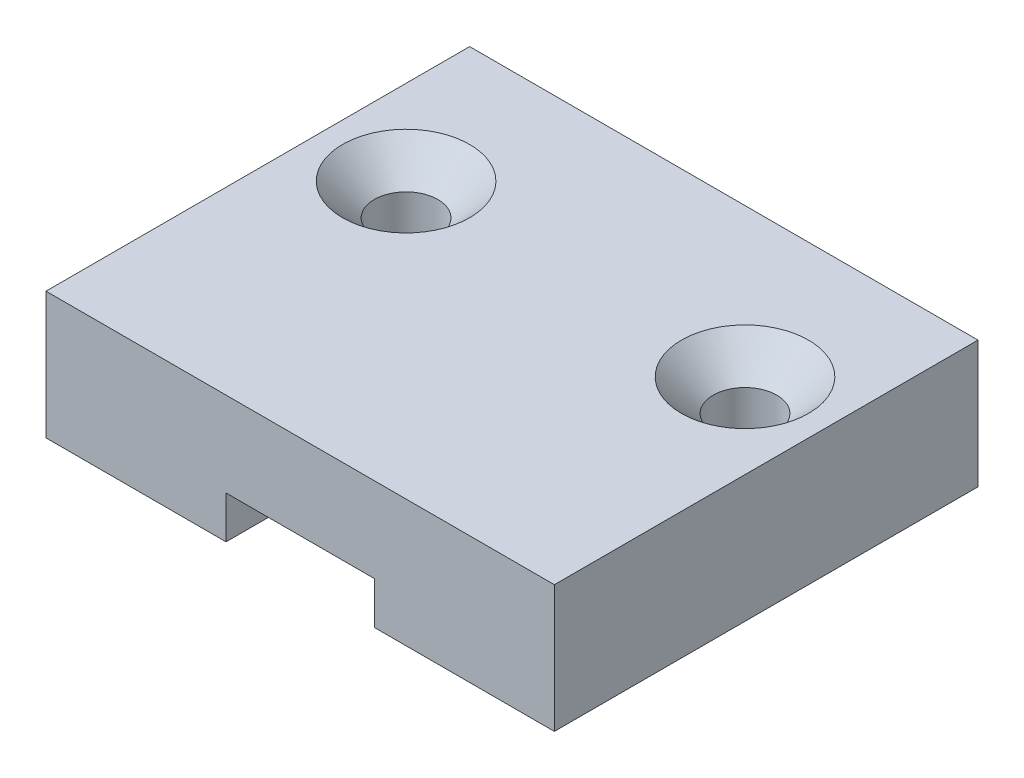
ISO-10303-21;
HEADER;
FILE_DESCRIPTION(('STEP AP214'),'2;1');
FILE_NAME('part.step','',(''),(''),'','','');
FILE_SCHEMA(('AUTOMOTIVE_DESIGN { 1 0 10303 214 1 1 1 1 }'));
ENDSEC;
DATA;
#1=APPLICATION_CONTEXT('core data for automotive mechanical design processes');
#2=APPLICATION_PROTOCOL_DEFINITION('international standard','automotive_design',2000,#1);
#3=PRODUCT_CONTEXT('',#1,'mechanical');
#4=PRODUCT('Part','Part','',(#3));
#5=PRODUCT_RELATED_PRODUCT_CATEGORY('part','',(#4));
#6=PRODUCT_DEFINITION_FORMATION('','',#4);
#7=PRODUCT_DEFINITION_CONTEXT('part definition',#1,'design');
#8=PRODUCT_DEFINITION('design','',#6,#7);
#9=PRODUCT_DEFINITION_SHAPE('','',#8);
#10=(LENGTH_UNIT() NAMED_UNIT(*) SI_UNIT(.MILLI.,.METRE.));
#11=(NAMED_UNIT(*) PLANE_ANGLE_UNIT() SI_UNIT($,.RADIAN.));
#12=(NAMED_UNIT(*) SI_UNIT($,.STERADIAN.) SOLID_ANGLE_UNIT());
#13=UNCERTAINTY_MEASURE_WITH_UNIT(LENGTH_MEASURE(1.E-05),#10,'distance_accuracy_value','');
#14=(GEOMETRIC_REPRESENTATION_CONTEXT(3) GLOBAL_UNCERTAINTY_ASSIGNED_CONTEXT((#13)) GLOBAL_UNIT_ASSIGNED_CONTEXT((#10,
#11,#12)) REPRESENTATION_CONTEXT('',''));
#15=CARTESIAN_POINT('',(0.,0.,0.));
#16=DIRECTION('',(0.,0.,1.));
#17=DIRECTION('',(1.,0.,0.));
#18=AXIS2_PLACEMENT_3D('',#15,#16,#17);
#19=CARTESIAN_POINT('',(0.,0.,0.));
#20=DIRECTION('',(0.,1.,0.));
#21=DIRECTION('',(0.,0.,1.));
#22=AXIS2_PLACEMENT_3D('',#19,#20,#21);
#23=PLANE('',#22);
#24=CARTESIAN_POINT('',(8.,0.,-13.));
#25=DIRECTION('',(0.,1.,0.));
#26=DIRECTION('',(0.,0.,1.));
#27=AXIS2_PLACEMENT_3D('',#24,#25,#26);
#28=CIRCLE('',#27,1.5);
#29=CARTESIAN_POINT('',(8.,0.,-11.5));
#30=VERTEX_POINT('',#29);
#31=EDGE_CURVE('E192',#30,#30,#28,.T.);
#32=ORIENTED_EDGE('',*,*,#31,.T.);
#33=EDGE_LOOP('',(#32));
#34=FACE_BOUND('',#33,.T.);
#35=DIRECTION('',(1.,0.,0.));
#36=VECTOR('',#35,1.);
#37=CARTESIAN_POINT('',(-12.,0.,0.));
#38=LINE('',#37,#36);
#39=CARTESIAN_POINT('',(3.5,0.,0.));
#40=VERTEX_POINT('',#39);
#41=CARTESIAN_POINT('',(12.,0.,0.));
#42=VERTEX_POINT('',#41);
#43=EDGE_CURVE('E207',#40,#42,#38,.T.);
#44=ORIENTED_EDGE('',*,*,#43,.F.);
#45=DIRECTION('',(0.,0.,1.));
#46=VECTOR('',#45,1.);
#47=CARTESIAN_POINT('',(3.5,0.,0.));
#48=LINE('',#47,#46);
#49=CARTESIAN_POINT('',(3.5,0.,-2.));
#50=VERTEX_POINT('',#49);
#51=EDGE_CURVE('E177',#50,#40,#48,.T.);
#52=ORIENTED_EDGE('',*,*,#51,.F.);
#53=DIRECTION('',(-1.,0.,0.));
#54=VECTOR('',#53,1.);
#55=CARTESIAN_POINT('',(3.5,0.,-2.));
#56=LINE('',#55,#54);
#57=CARTESIAN_POINT('',(7.,0.,-2.));
#58=VERTEX_POINT('',#57);
#59=EDGE_CURVE('E293',#58,#50,#56,.T.);
#60=ORIENTED_EDGE('',*,*,#59,.F.);
#61=DIRECTION('',(0.,0.,1.));
#62=VECTOR('',#61,1.);
#63=CARTESIAN_POINT('',(7.,0.,-2.));
#64=LINE('',#63,#62);
#65=CARTESIAN_POINT('',(7.,0.,-6.));
#66=VERTEX_POINT('',#65);
#67=EDGE_CURVE('E290',#66,#58,#64,.T.);
#68=ORIENTED_EDGE('',*,*,#67,.F.);
#69=DIRECTION('',(1.,0.,0.));
#70=VECTOR('',#69,1.);
#71=CARTESIAN_POINT('',(7.,0.,-6.));
#72=LINE('',#71,#70);
#73=CARTESIAN_POINT('',(6.,0.,-6.));
#74=VERTEX_POINT('',#73);
#75=EDGE_CURVE('E287',#74,#66,#72,.T.);
#76=ORIENTED_EDGE('',*,*,#75,.F.);
#77=DIRECTION('',(0.,0.,1.));
#78=VECTOR('',#77,1.);
#79=CARTESIAN_POINT('',(6.,0.,-6.));
#80=LINE('',#79,#78);
#81=CARTESIAN_POINT('',(6.,0.,-20.));
#82=VERTEX_POINT('',#81);
#83=EDGE_CURVE('E284',#82,#74,#80,.T.);
#84=ORIENTED_EDGE('',*,*,#83,.F.);
#85=DIRECTION('',(-1.,0.,0.));
#86=VECTOR('',#85,1.);
#87=CARTESIAN_POINT('',(-12.,0.,-20.));
#88=LINE('',#87,#86);
#89=CARTESIAN_POINT('',(12.,0.,-20.));
#90=VERTEX_POINT('',#89);
#91=EDGE_CURVE('E199',#90,#82,#88,.T.);
#92=ORIENTED_EDGE('',*,*,#91,.F.);
#93=DIRECTION('',(0.,0.,-1.));
#94=VECTOR('',#93,1.);
#95=CARTESIAN_POINT('',(12.,0.,-20.));
#96=LINE('',#95,#94);
#97=EDGE_CURVE('E209',#42,#90,#96,.T.);
#98=ORIENTED_EDGE('',*,*,#97,.F.);
#99=EDGE_LOOP('',(#44,#52,#60,#68,#76,#84,#92,#98));
#100=FACE_BOUND('',#99,.T.);
#101=ADVANCED_FACE('F33',(#34,#100),#23,.F.);
#102=CARTESIAN_POINT('',(0.,6.,0.));
#103=DIRECTION('',(0.,1.,0.));
#104=DIRECTION('',(0.,0.,1.));
#105=AXIS2_PLACEMENT_3D('',#102,#103,#104);
#106=PLANE('',#105);
#107=CARTESIAN_POINT('',(8.,6.,-13.));
#108=DIRECTION('',(0.,1.,0.));
#109=DIRECTION('',(0.,0.,1.));
#110=AXIS2_PLACEMENT_3D('',#107,#108,#109);
#111=CIRCLE('',#110,3.);
#112=CARTESIAN_POINT('',(8.,6.,-10.));
#113=VERTEX_POINT('',#112);
#114=EDGE_CURVE('E41',#113,#113,#111,.F.);
#115=ORIENTED_EDGE('',*,*,#114,.T.);
#116=EDGE_LOOP('',(#115));
#117=FACE_BOUND('',#116,.T.);
#118=CARTESIAN_POINT('',(-8.,6.,-13.));
#119=DIRECTION('',(0.,1.,0.));
#120=DIRECTION('',(0.,0.,1.));
#121=AXIS2_PLACEMENT_3D('',#118,#119,#120);
#122=CIRCLE('',#121,3.);
#123=CARTESIAN_POINT('',(-8.,6.,-10.));
#124=VERTEX_POINT('',#123);
#125=EDGE_CURVE('E225',#124,#124,#122,.F.);
#126=ORIENTED_EDGE('',*,*,#125,.T.);
#127=EDGE_LOOP('',(#126));
#128=FACE_BOUND('',#127,.T.);
#129=DIRECTION('',(0.,0.,1.));
#130=VECTOR('',#129,1.);
#131=CARTESIAN_POINT('',(-12.,6.,-20.));
#132=LINE('',#131,#130);
#133=CARTESIAN_POINT('',(-12.,6.,-20.));
#134=VERTEX_POINT('',#133);
#135=CARTESIAN_POINT('',(-12.,6.,0.));
#136=VERTEX_POINT('',#135);
#137=EDGE_CURVE('E197',#134,#136,#132,.T.);
#138=ORIENTED_EDGE('',*,*,#137,.T.);
#139=DIRECTION('',(1.,0.,0.));
#140=VECTOR('',#139,1.);
#141=CARTESIAN_POINT('',(-12.,6.,0.));
#142=LINE('',#141,#140);
#143=CARTESIAN_POINT('',(12.,6.,0.));
#144=VERTEX_POINT('',#143);
#145=EDGE_CURVE('E86',#136,#144,#142,.T.);
#146=ORIENTED_EDGE('',*,*,#145,.T.);
#147=DIRECTION('',(0.,0.,-1.));
#148=VECTOR('',#147,1.);
#149=CARTESIAN_POINT('',(12.,6.,-20.));
#150=LINE('',#149,#148);
#151=CARTESIAN_POINT('',(12.,6.,-20.));
#152=VERTEX_POINT('',#151);
#153=EDGE_CURVE('E201',#144,#152,#150,.T.);
#154=ORIENTED_EDGE('',*,*,#153,.T.);
#155=DIRECTION('',(-1.,0.,0.));
#156=VECTOR('',#155,1.);
#157=CARTESIAN_POINT('',(-12.,6.,-20.));
#158=LINE('',#157,#156);
#159=EDGE_CURVE('E57',#152,#134,#158,.T.);
#160=ORIENTED_EDGE('',*,*,#159,.T.);
#161=EDGE_LOOP('',(#138,#146,#154,#160));
#162=FACE_BOUND('',#161,.T.);
#163=ADVANCED_FACE('F230',(#117,#128,#162),#106,.T.);
#164=CARTESIAN_POINT('',(-6.,0.,-20.));
#165=VERTEX_POINT('',#164);
#166=CARTESIAN_POINT('',(-12.,0.,-20.));
#167=VERTEX_POINT('',#166);
#168=EDGE_CURVE('E78',#165,#167,#88,.T.);
#169=ORIENTED_EDGE('',*,*,#168,.F.);
#170=DIRECTION('',(0.,0.,-1.));
#171=VECTOR('',#170,1.);
#172=CARTESIAN_POINT('',(-6.,0.,-6.));
#173=LINE('',#172,#171);
#174=CARTESIAN_POINT('',(-6.,0.,-6.));
#175=VERTEX_POINT('',#174);
#176=EDGE_CURVE('E282',#175,#165,#173,.T.);
#177=ORIENTED_EDGE('',*,*,#176,.F.);
#178=DIRECTION('',(1.,0.,0.));
#179=VECTOR('',#178,1.);
#180=CARTESIAN_POINT('',(-7.,0.,-6.));
#181=LINE('',#180,#179);
#182=CARTESIAN_POINT('',(-7.,0.,-6.));
#183=VERTEX_POINT('',#182);
#184=EDGE_CURVE('E279',#183,#175,#181,.T.);
#185=ORIENTED_EDGE('',*,*,#184,.F.);
#186=DIRECTION('',(0.,0.,-1.));
#187=VECTOR('',#186,1.);
#188=CARTESIAN_POINT('',(-7.,0.,-2.));
#189=LINE('',#188,#187);
#190=CARTESIAN_POINT('',(-7.,0.,-2.));
#191=VERTEX_POINT('',#190);
#192=EDGE_CURVE('E273',#191,#183,#189,.T.);
#193=ORIENTED_EDGE('',*,*,#192,.F.);
#194=DIRECTION('',(-1.,0.,0.));
#195=VECTOR('',#194,1.);
#196=CARTESIAN_POINT('',(-3.5,0.,-2.));
#197=LINE('',#196,#195);
#198=CARTESIAN_POINT('',(-3.5,0.,-2.));
#199=VERTEX_POINT('',#198);
#200=EDGE_CURVE('E271',#199,#191,#197,.T.);
#201=ORIENTED_EDGE('',*,*,#200,.F.);
#202=DIRECTION('',(0.,0.,-1.));
#203=VECTOR('',#202,1.);
#204=CARTESIAN_POINT('',(-3.5,0.,0.));
#205=LINE('',#204,#203);
#206=CARTESIAN_POINT('',(-3.5,0.,0.));
#207=VERTEX_POINT('',#206);
#208=EDGE_CURVE('E268',#207,#199,#205,.T.);
#209=ORIENTED_EDGE('',*,*,#208,.F.);
#210=CARTESIAN_POINT('',(-12.,0.,0.));
#211=VERTEX_POINT('',#210);
#212=EDGE_CURVE('E181',#211,#207,#38,.T.);
#213=ORIENTED_EDGE('',*,*,#212,.F.);
#214=DIRECTION('',(0.,0.,1.));
#215=VECTOR('',#214,1.);
#216=CARTESIAN_POINT('',(-12.,0.,-20.));
#217=LINE('',#216,#215);
#218=EDGE_CURVE('E196',#167,#211,#217,.T.);
#219=ORIENTED_EDGE('',*,*,#218,.F.);
#220=EDGE_LOOP('',(#169,#177,#185,#193,#201,#209,#213,#219));
#221=FACE_BOUND('',#220,.T.);
#222=CARTESIAN_POINT('',(-8.,0.,-13.));
#223=DIRECTION('',(0.,1.,0.));
#224=DIRECTION('',(0.,0.,-1.));
#225=AXIS2_PLACEMENT_3D('',#222,#223,#224);
#226=CIRCLE('',#225,1.5);
#227=CARTESIAN_POINT('',(-8.,0.,-14.5));
#228=VERTEX_POINT('',#227);
#229=EDGE_CURVE('E189',#228,#228,#226,.T.);
#230=ORIENTED_EDGE('',*,*,#229,.T.);
#231=EDGE_LOOP('',(#230));
#232=FACE_BOUND('',#231,.T.);
#233=ADVANCED_FACE('F249',(#221,#232),#23,.F.);
#234=CARTESIAN_POINT('',(-12.,6.,-20.));
#235=DIRECTION('',(1.,0.,0.));
#236=DIRECTION('',(0.,0.,-1.));
#237=AXIS2_PLACEMENT_3D('',#234,#235,#236);
#238=PLANE('',#237);
#239=ORIENTED_EDGE('',*,*,#218,.T.);
#240=DIRECTION('',(0.,-1.,0.));
#241=VECTOR('',#240,1.);
#242=CARTESIAN_POINT('',(-12.,6.,0.));
#243=LINE('',#242,#241);
#244=EDGE_CURVE('E220',#136,#211,#243,.T.);
#245=ORIENTED_EDGE('',*,*,#244,.F.);
#246=ORIENTED_EDGE('',*,*,#137,.F.);
#247=DIRECTION('',(0.,-1.,0.));
#248=VECTOR('',#247,1.);
#249=CARTESIAN_POINT('',(-12.,6.,-20.));
#250=LINE('',#249,#248);
#251=EDGE_CURVE('E204',#134,#167,#250,.T.);
#252=ORIENTED_EDGE('',*,*,#251,.T.);
#253=EDGE_LOOP('',(#239,#245,#246,#252));
#254=FACE_BOUND('',#253,.T.);
#255=ADVANCED_FACE('F262',(#254),#238,.F.);
#256=CARTESIAN_POINT('',(-12.,6.,0.));
#257=DIRECTION('',(0.,0.,-1.));
#258=DIRECTION('',(-1.,0.,0.));
#259=AXIS2_PLACEMENT_3D('',#256,#257,#258);
#260=PLANE('',#259);
#261=DIRECTION('',(-1.,0.,0.));
#262=VECTOR('',#261,1.);
#263=CARTESIAN_POINT('',(-3.5,2.,0.));
#264=LINE('',#263,#262);
#265=CARTESIAN_POINT('',(3.5,2.,0.));
#266=VERTEX_POINT('',#265);
#267=CARTESIAN_POINT('',(-3.5,2.,0.));
#268=VERTEX_POINT('',#267);
#269=EDGE_CURVE('E168',#266,#268,#264,.T.);
#270=ORIENTED_EDGE('',*,*,#269,.F.);
#271=DIRECTION('',(0.,-1.,0.));
#272=VECTOR('',#271,1.);
#273=CARTESIAN_POINT('',(3.5,2.,0.));
#274=LINE('',#273,#272);
#275=EDGE_CURVE('E193',#266,#40,#274,.T.);
#276=ORIENTED_EDGE('',*,*,#275,.T.);
#277=ORIENTED_EDGE('',*,*,#43,.T.);
#278=DIRECTION('',(0.,-1.,0.));
#279=VECTOR('',#278,1.);
#280=CARTESIAN_POINT('',(12.,6.,0.));
#281=LINE('',#280,#279);
#282=EDGE_CURVE('E217',#144,#42,#281,.T.);
#283=ORIENTED_EDGE('',*,*,#282,.F.);
#284=ORIENTED_EDGE('',*,*,#145,.F.);
#285=ORIENTED_EDGE('',*,*,#244,.T.);
#286=ORIENTED_EDGE('',*,*,#212,.T.);
#287=DIRECTION('',(0.,-1.,0.));
#288=VECTOR('',#287,1.);
#289=CARTESIAN_POINT('',(-3.5,2.,0.));
#290=LINE('',#289,#288);
#291=EDGE_CURVE('E162',#268,#207,#290,.T.);
#292=ORIENTED_EDGE('',*,*,#291,.F.);
#293=EDGE_LOOP('',(#270,#276,#277,#283,#284,#285,#286,#292));
#294=FACE_BOUND('',#293,.T.);
#295=ADVANCED_FACE('F180',(#294),#260,.F.);
#296=CARTESIAN_POINT('',(12.,6.,-20.));
#297=DIRECTION('',(-1.,0.,0.));
#298=DIRECTION('',(0.,0.,1.));
#299=AXIS2_PLACEMENT_3D('',#296,#297,#298);
#300=PLANE('',#299);
#301=ORIENTED_EDGE('',*,*,#97,.T.);
#302=DIRECTION('',(0.,-1.,0.));
#303=VECTOR('',#302,1.);
#304=CARTESIAN_POINT('',(12.,6.,-20.));
#305=LINE('',#304,#303);
#306=EDGE_CURVE('E214',#152,#90,#305,.T.);
#307=ORIENTED_EDGE('',*,*,#306,.F.);
#308=ORIENTED_EDGE('',*,*,#153,.F.);
#309=ORIENTED_EDGE('',*,*,#282,.T.);
#310=EDGE_LOOP('',(#301,#307,#308,#309));
#311=FACE_BOUND('',#310,.T.);
#312=ADVANCED_FACE('F257',(#311),#300,.F.);
#313=CARTESIAN_POINT('',(-12.,6.,-20.));
#314=DIRECTION('',(0.,0.,1.));
#315=DIRECTION('',(1.,0.,0.));
#316=AXIS2_PLACEMENT_3D('',#313,#314,#315);
#317=PLANE('',#316);
#318=ORIENTED_EDGE('',*,*,#91,.T.);
#319=DIRECTION('',(0.,-1.,0.));
#320=VECTOR('',#319,1.);
#321=CARTESIAN_POINT('',(6.,2.,-20.));
#322=LINE('',#321,#320);
#323=CARTESIAN_POINT('',(6.,2.,-20.));
#324=VERTEX_POINT('',#323);
#325=EDGE_CURVE('E306',#324,#82,#322,.T.);
#326=ORIENTED_EDGE('',*,*,#325,.F.);
#327=DIRECTION('',(1.,0.,0.));
#328=VECTOR('',#327,1.);
#329=CARTESIAN_POINT('',(-6.,2.,-20.));
#330=LINE('',#329,#328);
#331=CARTESIAN_POINT('',(-6.,2.,-20.));
#332=VERTEX_POINT('',#331);
#333=EDGE_CURVE('E330',#332,#324,#330,.T.);
#334=ORIENTED_EDGE('',*,*,#333,.F.);
#335=DIRECTION('',(0.,-1.,0.));
#336=VECTOR('',#335,1.);
#337=CARTESIAN_POINT('',(-6.,2.,-20.));
#338=LINE('',#337,#336);
#339=EDGE_CURVE('E308',#332,#165,#338,.T.);
#340=ORIENTED_EDGE('',*,*,#339,.T.);
#341=ORIENTED_EDGE('',*,*,#168,.T.);
#342=ORIENTED_EDGE('',*,*,#251,.F.);
#343=ORIENTED_EDGE('',*,*,#159,.F.);
#344=ORIENTED_EDGE('',*,*,#306,.T.);
#345=EDGE_LOOP('',(#318,#326,#334,#340,#341,#342,#343,#344));
#346=FACE_BOUND('',#345,.T.);
#347=ADVANCED_FACE('F242',(#346),#317,.F.);
#348=CARTESIAN_POINT('',(8.,6.,-13.));
#349=DIRECTION('',(0.,-1.,0.));
#350=DIRECTION('',(0.,0.,-1.));
#351=AXIS2_PLACEMENT_3D('',#348,#349,#350);
#352=CYLINDRICAL_SURFACE('',#351,1.5);
#353=CARTESIAN_POINT('',(8.,4.5,-13.));
#354=DIRECTION('',(0.,1.,0.));
#355=DIRECTION('',(0.,0.,1.));
#356=AXIS2_PLACEMENT_3D('',#353,#354,#355);
#357=CIRCLE('',#356,1.5);
#358=CARTESIAN_POINT('',(8.,4.5,-11.5));
#359=VERTEX_POINT('',#358);
#360=EDGE_CURVE('E222',#359,#359,#357,.T.);
#361=ORIENTED_EDGE('',*,*,#360,.T.);
#362=EDGE_LOOP('',(#361));
#363=FACE_BOUND('',#362,.T.);
#364=ORIENTED_EDGE('',*,*,#31,.F.);
#365=EDGE_LOOP('',(#364));
#366=FACE_BOUND('',#365,.T.);
#367=ADVANCED_FACE('F238',(#363,#366),#352,.F.);
#368=CARTESIAN_POINT('',(-8.,6.,-13.));
#369=DIRECTION('',(0.,-1.,0.));
#370=DIRECTION('',(0.,0.,-1.));
#371=AXIS2_PLACEMENT_3D('',#368,#369,#370);
#372=CYLINDRICAL_SURFACE('',#371,1.5);
#373=CARTESIAN_POINT('',(-8.,4.5,-13.));
#374=DIRECTION('',(0.,1.,0.));
#375=DIRECTION('',(0.,0.,1.));
#376=AXIS2_PLACEMENT_3D('',#373,#374,#375);
#377=CIRCLE('',#376,1.5);
#378=CARTESIAN_POINT('',(-8.,4.5,-11.5));
#379=VERTEX_POINT('',#378);
#380=EDGE_CURVE('E11',#379,#379,#377,.T.);
#381=ORIENTED_EDGE('',*,*,#380,.T.);
#382=EDGE_LOOP('',(#381));
#383=FACE_BOUND('',#382,.T.);
#384=ORIENTED_EDGE('',*,*,#229,.F.);
#385=EDGE_LOOP('',(#384));
#386=FACE_BOUND('',#385,.T.);
#387=ADVANCED_FACE('F241',(#383,#386),#372,.F.);
#388=CARTESIAN_POINT('',(3.5,2.,0.));
#389=DIRECTION('',(1.,0.,0.));
#390=DIRECTION('',(0.,0.,-1.));
#391=AXIS2_PLACEMENT_3D('',#388,#389,#390);
#392=PLANE('',#391);
#393=ORIENTED_EDGE('',*,*,#51,.T.);
#394=ORIENTED_EDGE('',*,*,#275,.F.);
#395=DIRECTION('',(0.,0.,1.));
#396=VECTOR('',#395,1.);
#397=CARTESIAN_POINT('',(3.5,2.,0.));
#398=LINE('',#397,#396);
#399=CARTESIAN_POINT('',(3.5,2.,-2.));
#400=VERTEX_POINT('',#399);
#401=EDGE_CURVE('E175',#400,#266,#398,.T.);
#402=ORIENTED_EDGE('',*,*,#401,.F.);
#403=DIRECTION('',(0.,-1.,0.));
#404=VECTOR('',#403,1.);
#405=CARTESIAN_POINT('',(3.5,2.,-2.));
#406=LINE('',#405,#404);
#407=EDGE_CURVE('E298',#400,#50,#406,.T.);
#408=ORIENTED_EDGE('',*,*,#407,.T.);
#409=EDGE_LOOP('',(#393,#394,#402,#408));
#410=FACE_BOUND('',#409,.T.);
#411=ADVANCED_FACE('F344',(#410),#392,.F.);
#412=CARTESIAN_POINT('',(3.5,2.,-2.));
#413=DIRECTION('',(0.,0.,1.));
#414=DIRECTION('',(1.,0.,0.));
#415=AXIS2_PLACEMENT_3D('',#412,#413,#414);
#416=PLANE('',#415);
#417=ORIENTED_EDGE('',*,*,#59,.T.);
#418=ORIENTED_EDGE('',*,*,#407,.F.);
#419=DIRECTION('',(-1.,0.,0.));
#420=VECTOR('',#419,1.);
#421=CARTESIAN_POINT('',(3.5,2.,-2.));
#422=LINE('',#421,#420);
#423=CARTESIAN_POINT('',(7.,2.,-2.));
#424=VERTEX_POINT('',#423);
#425=EDGE_CURVE('E185',#424,#400,#422,.T.);
#426=ORIENTED_EDGE('',*,*,#425,.F.);
#427=DIRECTION('',(0.,-1.,0.));
#428=VECTOR('',#427,1.);
#429=CARTESIAN_POINT('',(7.,2.,-2.));
#430=LINE('',#429,#428);
#431=EDGE_CURVE('E300',#424,#58,#430,.T.);
#432=ORIENTED_EDGE('',*,*,#431,.T.);
#433=EDGE_LOOP('',(#417,#418,#426,#432));
#434=FACE_BOUND('',#433,.T.);
#435=ADVANCED_FACE('F345',(#434),#416,.F.);
#436=CARTESIAN_POINT('',(7.,2.,-2.));
#437=DIRECTION('',(1.,0.,0.));
#438=DIRECTION('',(0.,0.,-1.));
#439=AXIS2_PLACEMENT_3D('',#436,#437,#438);
#440=PLANE('',#439);
#441=ORIENTED_EDGE('',*,*,#67,.T.);
#442=ORIENTED_EDGE('',*,*,#431,.F.);
#443=DIRECTION('',(0.,0.,1.));
#444=VECTOR('',#443,1.);
#445=CARTESIAN_POINT('',(7.,2.,-2.));
#446=LINE('',#445,#444);
#447=CARTESIAN_POINT('',(7.,2.,-6.));
#448=VERTEX_POINT('',#447);
#449=EDGE_CURVE('E338',#448,#424,#446,.T.);
#450=ORIENTED_EDGE('',*,*,#449,.F.);
#451=DIRECTION('',(0.,-1.,0.));
#452=VECTOR('',#451,1.);
#453=CARTESIAN_POINT('',(7.,2.,-6.));
#454=LINE('',#453,#452);
#455=EDGE_CURVE('E302',#448,#66,#454,.T.);
#456=ORIENTED_EDGE('',*,*,#455,.T.);
#457=EDGE_LOOP('',(#441,#442,#450,#456));
#458=FACE_BOUND('',#457,.T.);
#459=ADVANCED_FACE('F350',(#458),#440,.F.);
#460=CARTESIAN_POINT('',(7.,2.,-6.));
#461=DIRECTION('',(0.,0.,-1.));
#462=DIRECTION('',(-1.,0.,0.));
#463=AXIS2_PLACEMENT_3D('',#460,#461,#462);
#464=PLANE('',#463);
#465=ORIENTED_EDGE('',*,*,#75,.T.);
#466=ORIENTED_EDGE('',*,*,#455,.F.);
#467=DIRECTION('',(1.,0.,0.));
#468=VECTOR('',#467,1.);
#469=CARTESIAN_POINT('',(7.,2.,-6.));
#470=LINE('',#469,#468);
#471=CARTESIAN_POINT('',(6.,2.,-6.));
#472=VERTEX_POINT('',#471);
#473=EDGE_CURVE('E335',#472,#448,#470,.T.);
#474=ORIENTED_EDGE('',*,*,#473,.F.);
#475=DIRECTION('',(0.,-1.,0.));
#476=VECTOR('',#475,1.);
#477=CARTESIAN_POINT('',(6.,2.,-6.));
#478=LINE('',#477,#476);
#479=EDGE_CURVE('E304',#472,#74,#478,.T.);
#480=ORIENTED_EDGE('',*,*,#479,.T.);
#481=EDGE_LOOP('',(#465,#466,#474,#480));
#482=FACE_BOUND('',#481,.T.);
#483=ADVANCED_FACE('F353',(#482),#464,.F.);
#484=CARTESIAN_POINT('',(6.,2.,-6.));
#485=DIRECTION('',(1.,0.,0.));
#486=DIRECTION('',(0.,0.,-1.));
#487=AXIS2_PLACEMENT_3D('',#484,#485,#486);
#488=PLANE('',#487);
#489=ORIENTED_EDGE('',*,*,#83,.T.);
#490=ORIENTED_EDGE('',*,*,#479,.F.);
#491=DIRECTION('',(0.,0.,1.));
#492=VECTOR('',#491,1.);
#493=CARTESIAN_POINT('',(6.,2.,-6.));
#494=LINE('',#493,#492);
#495=EDGE_CURVE('E332',#324,#472,#494,.T.);
#496=ORIENTED_EDGE('',*,*,#495,.F.);
#497=ORIENTED_EDGE('',*,*,#325,.T.);
#498=EDGE_LOOP('',(#489,#490,#496,#497));
#499=FACE_BOUND('',#498,.T.);
#500=ADVANCED_FACE('F355',(#499),#488,.F.);
#501=CARTESIAN_POINT('',(-6.,2.,-6.));
#502=DIRECTION('',(-1.,0.,0.));
#503=DIRECTION('',(0.,0.,1.));
#504=AXIS2_PLACEMENT_3D('',#501,#502,#503);
#505=PLANE('',#504);
#506=ORIENTED_EDGE('',*,*,#176,.T.);
#507=ORIENTED_EDGE('',*,*,#339,.F.);
#508=DIRECTION('',(0.,0.,-1.));
#509=VECTOR('',#508,1.);
#510=CARTESIAN_POINT('',(-6.,2.,-6.));
#511=LINE('',#510,#509);
#512=CARTESIAN_POINT('',(-6.,2.,-6.));
#513=VERTEX_POINT('',#512);
#514=EDGE_CURVE('E48',#513,#332,#511,.T.);
#515=ORIENTED_EDGE('',*,*,#514,.F.);
#516=DIRECTION('',(0.,-1.,0.));
#517=VECTOR('',#516,1.);
#518=CARTESIAN_POINT('',(-6.,2.,-6.));
#519=LINE('',#518,#517);
#520=EDGE_CURVE('E310',#513,#175,#519,.T.);
#521=ORIENTED_EDGE('',*,*,#520,.T.);
#522=EDGE_LOOP('',(#506,#507,#515,#521));
#523=FACE_BOUND('',#522,.T.);
#524=ADVANCED_FACE('F359',(#523),#505,.F.);
#525=CARTESIAN_POINT('',(-7.,2.,-6.));
#526=DIRECTION('',(0.,0.,-1.));
#527=DIRECTION('',(-1.,0.,0.));
#528=AXIS2_PLACEMENT_3D('',#525,#526,#527);
#529=PLANE('',#528);
#530=ORIENTED_EDGE('',*,*,#184,.T.);
#531=ORIENTED_EDGE('',*,*,#520,.F.);
#532=DIRECTION('',(1.,0.,0.));
#533=VECTOR('',#532,1.);
#534=CARTESIAN_POINT('',(-7.,2.,-6.));
#535=LINE('',#534,#533);
#536=CARTESIAN_POINT('',(-7.,2.,-6.));
#537=VERTEX_POINT('',#536);
#538=EDGE_CURVE('E324',#537,#513,#535,.T.);
#539=ORIENTED_EDGE('',*,*,#538,.F.);
#540=DIRECTION('',(0.,-1.,0.));
#541=VECTOR('',#540,1.);
#542=CARTESIAN_POINT('',(-7.,2.,-6.));
#543=LINE('',#542,#541);
#544=EDGE_CURVE('E312',#537,#183,#543,.T.);
#545=ORIENTED_EDGE('',*,*,#544,.T.);
#546=EDGE_LOOP('',(#530,#531,#539,#545));
#547=FACE_BOUND('',#546,.T.);
#548=ADVANCED_FACE('F322',(#547),#529,.F.);
#549=CARTESIAN_POINT('',(-7.,2.,-2.));
#550=DIRECTION('',(-1.,0.,0.));
#551=DIRECTION('',(0.,0.,1.));
#552=AXIS2_PLACEMENT_3D('',#549,#550,#551);
#553=PLANE('',#552);
#554=ORIENTED_EDGE('',*,*,#192,.T.);
#555=ORIENTED_EDGE('',*,*,#544,.F.);
#556=DIRECTION('',(0.,0.,-1.));
#557=VECTOR('',#556,1.);
#558=CARTESIAN_POINT('',(-7.,2.,-2.));
#559=LINE('',#558,#557);
#560=CARTESIAN_POINT('',(-7.,2.,-2.));
#561=VERTEX_POINT('',#560);
#562=EDGE_CURVE('E318',#561,#537,#559,.T.);
#563=ORIENTED_EDGE('',*,*,#562,.F.);
#564=DIRECTION('',(0.,-1.,0.));
#565=VECTOR('',#564,1.);
#566=CARTESIAN_POINT('',(-7.,2.,-2.));
#567=LINE('',#566,#565);
#568=EDGE_CURVE('E183',#561,#191,#567,.T.);
#569=ORIENTED_EDGE('',*,*,#568,.T.);
#570=EDGE_LOOP('',(#554,#555,#563,#569));
#571=FACE_BOUND('',#570,.T.);
#572=ADVANCED_FACE('F315',(#571),#553,.F.);
#573=CARTESIAN_POINT('',(-3.5,2.,-2.));
#574=DIRECTION('',(0.,0.,1.));
#575=DIRECTION('',(1.,0.,0.));
#576=AXIS2_PLACEMENT_3D('',#573,#574,#575);
#577=PLANE('',#576);
#578=ORIENTED_EDGE('',*,*,#200,.T.);
#579=ORIENTED_EDGE('',*,*,#568,.F.);
#580=DIRECTION('',(-1.,0.,0.));
#581=VECTOR('',#580,1.);
#582=CARTESIAN_POINT('',(-3.5,2.,-2.));
#583=LINE('',#582,#581);
#584=CARTESIAN_POINT('',(-3.5,2.,-2.));
#585=VERTEX_POINT('',#584);
#586=EDGE_CURVE('E167',#585,#561,#583,.T.);
#587=ORIENTED_EDGE('',*,*,#586,.F.);
#588=DIRECTION('',(0.,-1.,0.));
#589=VECTOR('',#588,1.);
#590=CARTESIAN_POINT('',(-3.5,2.,-2.));
#591=LINE('',#590,#589);
#592=EDGE_CURVE('E164',#585,#199,#591,.T.);
#593=ORIENTED_EDGE('',*,*,#592,.T.);
#594=EDGE_LOOP('',(#578,#579,#587,#593));
#595=FACE_BOUND('',#594,.T.);
#596=ADVANCED_FACE('F320',(#595),#577,.F.);
#597=CARTESIAN_POINT('',(-3.5,2.,0.));
#598=DIRECTION('',(-1.,0.,0.));
#599=DIRECTION('',(0.,0.,1.));
#600=AXIS2_PLACEMENT_3D('',#597,#598,#599);
#601=PLANE('',#600);
#602=ORIENTED_EDGE('',*,*,#208,.T.);
#603=ORIENTED_EDGE('',*,*,#592,.F.);
#604=DIRECTION('',(0.,0.,-1.));
#605=VECTOR('',#604,1.);
#606=CARTESIAN_POINT('',(-3.5,2.,0.));
#607=LINE('',#606,#605);
#608=EDGE_CURVE('E157',#268,#585,#607,.T.);
#609=ORIENTED_EDGE('',*,*,#608,.F.);
#610=ORIENTED_EDGE('',*,*,#291,.T.);
#611=EDGE_LOOP('',(#602,#603,#609,#610));
#612=FACE_BOUND('',#611,.T.);
#613=ADVANCED_FACE('F160',(#612),#601,.F.);
#614=CARTESIAN_POINT('',(0.,2.,0.));
#615=DIRECTION('',(0.,1.,0.));
#616=DIRECTION('',(0.,0.,1.));
#617=AXIS2_PLACEMENT_3D('',#614,#615,#616);
#618=PLANE('',#617);
#619=ORIENTED_EDGE('',*,*,#269,.T.);
#620=ORIENTED_EDGE('',*,*,#608,.T.);
#621=ORIENTED_EDGE('',*,*,#586,.T.);
#622=ORIENTED_EDGE('',*,*,#562,.T.);
#623=ORIENTED_EDGE('',*,*,#538,.T.);
#624=ORIENTED_EDGE('',*,*,#514,.T.);
#625=ORIENTED_EDGE('',*,*,#333,.T.);
#626=ORIENTED_EDGE('',*,*,#495,.T.);
#627=ORIENTED_EDGE('',*,*,#473,.T.);
#628=ORIENTED_EDGE('',*,*,#449,.T.);
#629=ORIENTED_EDGE('',*,*,#425,.T.);
#630=ORIENTED_EDGE('',*,*,#401,.T.);
#631=EDGE_LOOP('',(#619,#620,#621,#622,#623,#624,#625,#626,#627,#628,#629,#630));
#632=FACE_BOUND('',#631,.T.);
#633=ADVANCED_FACE('F172',(#632),#618,.F.);
#634=CARTESIAN_POINT('',(8.,4.5,-13.));
#635=DIRECTION('',(0.,1.,0.));
#636=DIRECTION('',(0.,0.,1.));
#637=AXIS2_PLACEMENT_3D('',#634,#635,#636);
#638=CONICAL_SURFACE('',#637,1.5,0.78539816339745);
#639=ORIENTED_EDGE('',*,*,#114,.F.);
#640=EDGE_LOOP('',(#639));
#641=FACE_BOUND('',#640,.T.);
#642=ORIENTED_EDGE('',*,*,#360,.F.);
#643=EDGE_LOOP('',(#642));
#644=FACE_BOUND('',#643,.T.);
#645=ADVANCED_FACE('F233',(#641,#644),#638,.F.);
#646=CARTESIAN_POINT('',(-8.,4.5,-13.));
#647=DIRECTION('',(0.,1.,0.));
#648=DIRECTION('',(0.,0.,1.));
#649=AXIS2_PLACEMENT_3D('',#646,#647,#648);
#650=CONICAL_SURFACE('',#649,1.5,0.78539816339745);
#651=ORIENTED_EDGE('',*,*,#125,.F.);
#652=EDGE_LOOP('',(#651));
#653=FACE_BOUND('',#652,.T.);
#654=ORIENTED_EDGE('',*,*,#380,.F.);
#655=EDGE_LOOP('',(#654));
#656=FACE_BOUND('',#655,.T.);
#657=ADVANCED_FACE('F35',(#653,#656),#650,.F.);
#658=CLOSED_SHELL('',(#101,#163,#233,#255,#295,#312,#347,#367,#387,#411,#435,#459,#483,#500,
#524,#548,#572,#596,#613,#633,#645,#657));
#659=MANIFOLD_SOLID_BREP('B2',#658);
#660=ADVANCED_BREP_SHAPE_REPRESENTATION('',(#18,#659),#14);
#661=SHAPE_DEFINITION_REPRESENTATION(#9,#660);
ENDSEC;
END-ISO-10303-21;
